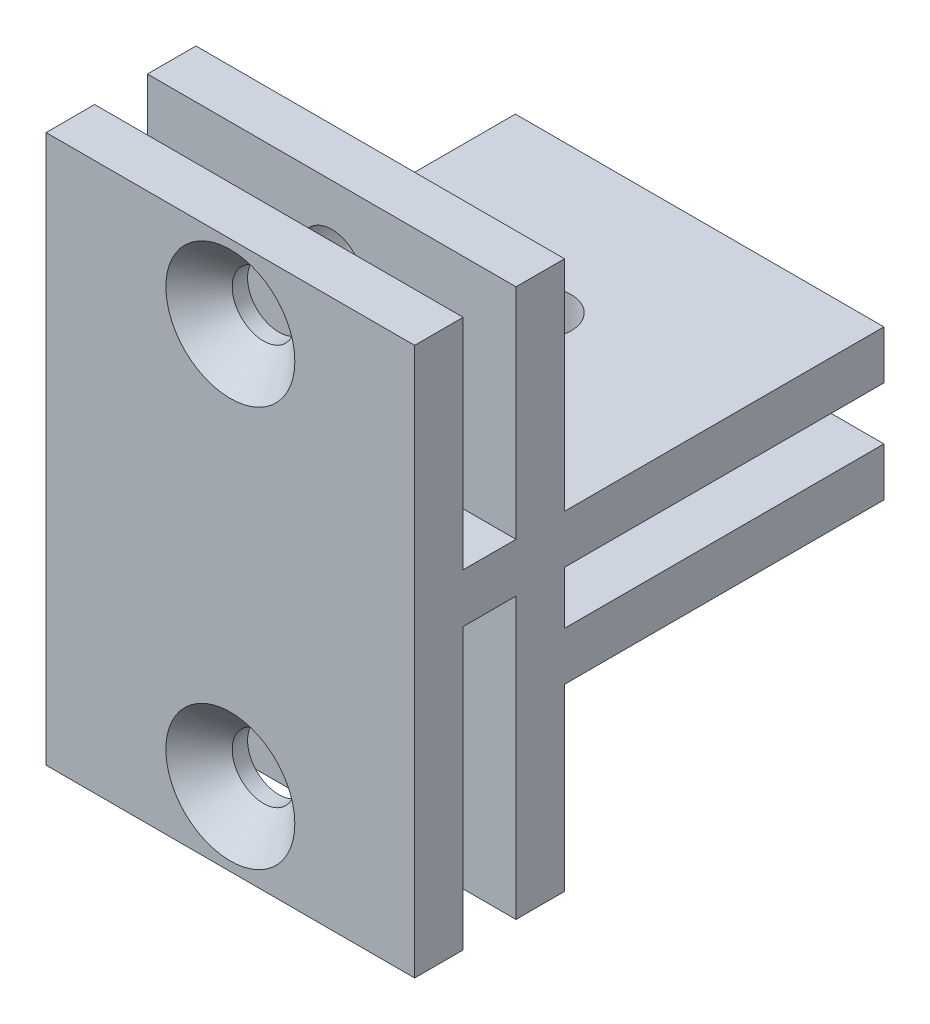
ISO-10303-21;
HEADER;
FILE_DESCRIPTION(('STEP AP214'),'2;1');
FILE_NAME('part.step','',(''),(''),'','','');
FILE_SCHEMA(('AUTOMOTIVE_DESIGN { 1 0 10303 214 1 1 1 1 }'));
ENDSEC;
DATA;
#1=APPLICATION_CONTEXT('core data for automotive mechanical design processes');
#2=APPLICATION_PROTOCOL_DEFINITION('international standard','automotive_design',2000,#1);
#3=PRODUCT_CONTEXT('',#1,'mechanical');
#4=PRODUCT('Part','Part','',(#3));
#5=PRODUCT_RELATED_PRODUCT_CATEGORY('part','',(#4));
#6=PRODUCT_DEFINITION_FORMATION('','',#4);
#7=PRODUCT_DEFINITION_CONTEXT('part definition',#1,'design');
#8=PRODUCT_DEFINITION('design','',#6,#7);
#9=PRODUCT_DEFINITION_SHAPE('','',#8);
#10=(LENGTH_UNIT() NAMED_UNIT(*) SI_UNIT(.MILLI.,.METRE.));
#11=(NAMED_UNIT(*) PLANE_ANGLE_UNIT() SI_UNIT($,.RADIAN.));
#12=(NAMED_UNIT(*) SI_UNIT($,.STERADIAN.) SOLID_ANGLE_UNIT());
#13=UNCERTAINTY_MEASURE_WITH_UNIT(LENGTH_MEASURE(1.E-05),#10,'distance_accuracy_value','');
#14=(GEOMETRIC_REPRESENTATION_CONTEXT(3) GLOBAL_UNCERTAINTY_ASSIGNED_CONTEXT((#13)) GLOBAL_UNIT_ASSIGNED_CONTEXT((#10,
#11,#12)) REPRESENTATION_CONTEXT('',''));
#15=CARTESIAN_POINT('',(0.,0.,0.));
#16=DIRECTION('',(0.,0.,1.));
#17=DIRECTION('',(1.,0.,0.));
#18=AXIS2_PLACEMENT_3D('',#15,#16,#17);
#19=CARTESIAN_POINT('',(0.,0.,-26.));
#20=DIRECTION('',(0.,0.,1.));
#21=DIRECTION('',(1.,0.,0.));
#22=AXIS2_PLACEMENT_3D('',#19,#20,#21);
#23=PLANE('',#22);
#24=DIRECTION('',(0.,-1.,0.));
#25=VECTOR('',#24,1.);
#26=CARTESIAN_POINT('',(-11.0854271356784,19.486432160804,-26.));
#27=LINE('',#26,#25);
#28=CARTESIAN_POINT('',(-11.0854271356784,19.486432160804,-26.));
#29=VERTEX_POINT('',#28);
#30=CARTESIAN_POINT('',(-11.0854271356784,15.536432160804,-26.));
#31=VERTEX_POINT('',#30);
#32=EDGE_CURVE('E235',#29,#31,#27,.T.);
#33=ORIENTED_EDGE('',*,*,#32,.T.);
#34=DIRECTION('',(-1.,0.,0.));
#35=VECTOR('',#34,1.);
#36=CARTESIAN_POINT('',(-11.0854271356784,15.536432160804,-26.));
#37=LINE('',#36,#35);
#38=CARTESIAN_POINT('',(-41.0854271356784,15.536432160804,-26.));
#39=VERTEX_POINT('',#38);
#40=EDGE_CURVE('E218',#31,#39,#37,.T.);
#41=ORIENTED_EDGE('',*,*,#40,.T.);
#42=DIRECTION('',(0.,1.,0.));
#43=VECTOR('',#42,1.);
#44=CARTESIAN_POINT('',(-41.0854271356784,19.486432160804,-26.));
#45=LINE('',#44,#43);
#46=CARTESIAN_POINT('',(-41.0854271356784,19.486432160804,-26.));
#47=VERTEX_POINT('',#46);
#48=EDGE_CURVE('E232',#39,#47,#45,.T.);
#49=ORIENTED_EDGE('',*,*,#48,.T.);
#50=DIRECTION('',(1.,0.,0.));
#51=VECTOR('',#50,1.);
#52=CARTESIAN_POINT('',(-41.0854271356784,19.486432160804,-26.));
#53=LINE('',#52,#51);
#54=EDGE_CURVE('E231',#47,#29,#53,.T.);
#55=ORIENTED_EDGE('',*,*,#54,.T.);
#56=EDGE_LOOP('',(#33,#41,#49,#55));
#57=FACE_BOUND('',#56,.T.);
#58=ADVANCED_FACE('F38',(#57),#23,.F.);
#59=CARTESIAN_POINT('',(0.,0.,0.));
#60=DIRECTION('',(0.,0.,1.));
#61=DIRECTION('',(1.,0.,0.));
#62=AXIS2_PLACEMENT_3D('',#59,#60,#61);
#63=PLANE('',#62);
#64=CARTESIAN_POINT('',(-26.0854271356784,-1.31356783919598,0.));
#65=DIRECTION('',(0.,0.,1.));
#66=DIRECTION('',(1.,0.,0.));
#67=AXIS2_PLACEMENT_3D('',#64,#65,#66);
#68=CIRCLE('',#67,2.54999998);
#69=CARTESIAN_POINT('',(-23.5354271556784,-1.31356783919598,0.));
#70=VERTEX_POINT('',#69);
#71=EDGE_CURVE('E271',#70,#70,#68,.T.);
#72=ORIENTED_EDGE('',*,*,#71,.T.);
#73=EDGE_LOOP('',(#72));
#74=FACE_BOUND('',#73,.T.);
#75=DIRECTION('',(-1.,0.,0.));
#76=VECTOR('',#75,1.);
#77=CARTESIAN_POINT('',(-41.0854271356784,7.28643216080402,0.));
#78=LINE('',#77,#76);
#79=CARTESIAN_POINT('',(-11.0854271356784,7.28643216080402,0.));
#80=VERTEX_POINT('',#79);
#81=CARTESIAN_POINT('',(-41.0854271356784,7.28643216080402,0.));
#82=VERTEX_POINT('',#81);
#83=EDGE_CURVE('E64',#80,#82,#78,.T.);
#84=ORIENTED_EDGE('',*,*,#83,.F.);
#85=DIRECTION('',(0.,1.,0.));
#86=VECTOR('',#85,1.);
#87=CARTESIAN_POINT('',(-11.0854271356784,37.286432160804,0.));
#88=LINE('',#87,#86);
#89=CARTESIAN_POINT('',(-11.0854271356784,-7.31356783919598,0.));
#90=VERTEX_POINT('',#89);
#91=EDGE_CURVE('E391',#90,#80,#88,.T.);
#92=ORIENTED_EDGE('',*,*,#91,.F.);
#93=DIRECTION('',(1.,0.,0.));
#94=VECTOR('',#93,1.);
#95=CARTESIAN_POINT('',(-41.0854271356784,-7.31356783919598,0.));
#96=LINE('',#95,#94);
#97=CARTESIAN_POINT('',(-41.0854271356784,-7.31356783919598,0.));
#98=VERTEX_POINT('',#97);
#99=EDGE_CURVE('E386',#98,#90,#96,.T.);
#100=ORIENTED_EDGE('',*,*,#99,.F.);
#101=DIRECTION('',(0.,-1.,0.));
#102=VECTOR('',#101,1.);
#103=CARTESIAN_POINT('',(-41.0854271356784,37.286432160804,0.));
#104=LINE('',#103,#102);
#105=EDGE_CURVE('E357',#82,#98,#104,.T.);
#106=ORIENTED_EDGE('',*,*,#105,.F.);
#107=EDGE_LOOP('',(#84,#92,#100,#106));
#108=FACE_BOUND('',#107,.T.);
#109=ADVANCED_FACE('F440',(#74,#108),#63,.F.);
#110=CARTESIAN_POINT('',(-26.0854271356784,31.286432160804,0.));
#111=DIRECTION('',(0.,0.,1.));
#112=DIRECTION('',(1.,0.,0.));
#113=AXIS2_PLACEMENT_3D('',#110,#111,#112);
#114=CIRCLE('',#113,2.54999998);
#115=CARTESIAN_POINT('',(-23.5354271556784,31.286432160804,0.));
#116=VERTEX_POINT('',#115);
#117=EDGE_CURVE('E288',#116,#116,#114,.T.);
#118=ORIENTED_EDGE('',*,*,#117,.T.);
#119=EDGE_LOOP('',(#118));
#120=FACE_BOUND('',#119,.T.);
#121=DIRECTION('',(1.,0.,0.));
#122=VECTOR('',#121,1.);
#123=CARTESIAN_POINT('',(-41.0854271356784,19.486432160804,0.));
#124=LINE('',#123,#122);
#125=CARTESIAN_POINT('',(-41.0854271356784,19.486432160804,0.));
#126=VERTEX_POINT('',#125);
#127=CARTESIAN_POINT('',(-11.0854271356784,19.486432160804,0.));
#128=VERTEX_POINT('',#127);
#129=EDGE_CURVE('E222',#126,#128,#124,.T.);
#130=ORIENTED_EDGE('',*,*,#129,.F.);
#131=CARTESIAN_POINT('',(-41.0854271356784,37.286432160804,0.));
#132=VERTEX_POINT('',#131);
#133=EDGE_CURVE('E382',#132,#126,#104,.T.);
#134=ORIENTED_EDGE('',*,*,#133,.F.);
#135=DIRECTION('',(-1.,0.,0.));
#136=VECTOR('',#135,1.);
#137=CARTESIAN_POINT('',(-41.0854271356784,37.286432160804,0.));
#138=LINE('',#137,#136);
#139=CARTESIAN_POINT('',(-11.0854271356784,37.286432160804,0.));
#140=VERTEX_POINT('',#139);
#141=EDGE_CURVE('E372',#140,#132,#138,.T.);
#142=ORIENTED_EDGE('',*,*,#141,.F.);
#143=EDGE_CURVE('E390',#128,#140,#88,.T.);
#144=ORIENTED_EDGE('',*,*,#143,.F.);
#145=EDGE_LOOP('',(#130,#134,#142,#144));
#146=FACE_BOUND('',#145,.T.);
#147=ADVANCED_FACE('F447',(#120,#146),#63,.F.);
#148=CARTESIAN_POINT('',(-41.0854271356784,-7.31356783919598,12.2));
#149=DIRECTION('',(0.,1.,0.));
#150=DIRECTION('',(0.,0.,1.));
#151=AXIS2_PLACEMENT_3D('',#148,#149,#150);
#152=PLANE('',#151);
#153=DIRECTION('',(0.,0.,-1.));
#154=VECTOR('',#153,1.);
#155=CARTESIAN_POINT('',(-11.0854271356784,-7.31356783919598,12.2));
#156=LINE('',#155,#154);
#157=CARTESIAN_POINT('',(-11.0854271356784,-7.31356783919598,3.95));
#158=VERTEX_POINT('',#157);
#159=EDGE_CURVE('E406',#158,#90,#156,.T.);
#160=ORIENTED_EDGE('',*,*,#159,.F.);
#161=DIRECTION('',(1.,0.,0.));
#162=VECTOR('',#161,1.);
#163=CARTESIAN_POINT('',(-11.0854271356784,-7.31356783919598,3.95));
#164=LINE('',#163,#162);
#165=CARTESIAN_POINT('',(-41.0854271356784,-7.31356783919598,3.95));
#166=VERTEX_POINT('',#165);
#167=EDGE_CURVE('E303',#166,#158,#164,.T.);
#168=ORIENTED_EDGE('',*,*,#167,.F.);
#169=DIRECTION('',(0.,0.,-1.));
#170=VECTOR('',#169,1.);
#171=CARTESIAN_POINT('',(-41.0854271356784,-7.31356783919598,12.2));
#172=LINE('',#171,#170);
#173=EDGE_CURVE('E48',#166,#98,#172,.T.);
#174=ORIENTED_EDGE('',*,*,#173,.T.);
#175=ORIENTED_EDGE('',*,*,#99,.T.);
#176=EDGE_LOOP('',(#160,#168,#174,#175));
#177=FACE_BOUND('',#176,.T.);
#178=ADVANCED_FACE('F499',(#177),#152,.F.);
#179=CARTESIAN_POINT('',(-41.0854271356784,37.286432160804,12.2));
#180=DIRECTION('',(0.,-1.,0.));
#181=DIRECTION('',(0.,0.,-1.));
#182=AXIS2_PLACEMENT_3D('',#179,#180,#181);
#183=PLANE('',#182);
#184=DIRECTION('',(0.,0.,-1.));
#185=VECTOR('',#184,1.);
#186=CARTESIAN_POINT('',(-41.0854271356784,37.286432160804,12.2));
#187=LINE('',#186,#185);
#188=CARTESIAN_POINT('',(-41.0854271356784,37.286432160804,3.95));
#189=VERTEX_POINT('',#188);
#190=EDGE_CURVE('E381',#189,#132,#187,.T.);
#191=ORIENTED_EDGE('',*,*,#190,.F.);
#192=DIRECTION('',(-1.,0.,0.));
#193=VECTOR('',#192,1.);
#194=CARTESIAN_POINT('',(-41.0854271356784,37.286432160804,3.95));
#195=LINE('',#194,#193);
#196=CARTESIAN_POINT('',(-11.0854271356784,37.286432160804,3.95));
#197=VERTEX_POINT('',#196);
#198=EDGE_CURVE('E337',#197,#189,#195,.T.);
#199=ORIENTED_EDGE('',*,*,#198,.F.);
#200=DIRECTION('',(0.,0.,-1.));
#201=VECTOR('',#200,1.);
#202=CARTESIAN_POINT('',(-11.0854271356784,37.286432160804,12.2));
#203=LINE('',#202,#201);
#204=EDGE_CURVE('E401',#197,#140,#203,.T.);
#205=ORIENTED_EDGE('',*,*,#204,.T.);
#206=ORIENTED_EDGE('',*,*,#141,.T.);
#207=EDGE_LOOP('',(#191,#199,#205,#206));
#208=FACE_BOUND('',#207,.T.);
#209=ADVANCED_FACE('F486',(#208),#183,.F.);
#210=CARTESIAN_POINT('',(-41.0854271356784,37.286432160804,12.2));
#211=DIRECTION('',(1.,0.,0.));
#212=DIRECTION('',(0.,0.,-1.));
#213=AXIS2_PLACEMENT_3D('',#210,#211,#212);
#214=PLANE('',#213);
#215=ORIENTED_EDGE('',*,*,#48,.F.);
#216=DIRECTION('',(0.,0.,-1.));
#217=VECTOR('',#216,1.);
#218=CARTESIAN_POINT('',(-41.0854271356784,15.536432160804,-26.));
#219=LINE('',#218,#217);
#220=CARTESIAN_POINT('',(-41.0854271356784,15.536432160804,0.));
#221=VERTEX_POINT('',#220);
#222=EDGE_CURVE('E203',#221,#39,#219,.T.);
#223=ORIENTED_EDGE('',*,*,#222,.F.);
#224=DIRECTION('',(0.,1.,0.));
#225=VECTOR('',#224,1.);
#226=CARTESIAN_POINT('',(-41.0854271356784,11.236432160804,0.));
#227=LINE('',#226,#225);
#228=CARTESIAN_POINT('',(-41.0854271356784,11.236432160804,0.));
#229=VERTEX_POINT('',#228);
#230=EDGE_CURVE('E206',#229,#221,#227,.T.);
#231=ORIENTED_EDGE('',*,*,#230,.F.);
#232=DIRECTION('',(0.,0.,1.));
#233=VECTOR('',#232,1.);
#234=CARTESIAN_POINT('',(-41.0854271356784,11.236432160804,-26.));
#235=LINE('',#234,#233);
#236=CARTESIAN_POINT('',(-41.0854271356784,11.236432160804,-26.));
#237=VERTEX_POINT('',#236);
#238=EDGE_CURVE('E181',#237,#229,#235,.T.);
#239=ORIENTED_EDGE('',*,*,#238,.F.);
#240=CARTESIAN_POINT('',(-41.0854271356784,7.28643216080402,-26.));
#241=VERTEX_POINT('',#240);
#242=EDGE_CURVE('E227',#241,#237,#45,.T.);
#243=ORIENTED_EDGE('',*,*,#242,.F.);
#244=DIRECTION('',(0.,0.,1.));
#245=VECTOR('',#244,1.);
#246=CARTESIAN_POINT('',(-41.0854271356784,7.28643216080402,-26.));
#247=LINE('',#246,#245);
#248=EDGE_CURVE('E242',#241,#82,#247,.T.);
#249=ORIENTED_EDGE('',*,*,#248,.T.);
#250=ORIENTED_EDGE('',*,*,#105,.T.);
#251=ORIENTED_EDGE('',*,*,#173,.F.);
#252=DIRECTION('',(0.,-1.,0.));
#253=VECTOR('',#252,1.);
#254=CARTESIAN_POINT('',(-41.0854271356784,15.486432160804,3.95));
#255=LINE('',#254,#253);
#256=CARTESIAN_POINT('',(-41.0854271356784,15.486432160804,3.95));
#257=VERTEX_POINT('',#256);
#258=EDGE_CURVE('E323',#257,#166,#255,.T.);
#259=ORIENTED_EDGE('',*,*,#258,.F.);
#260=DIRECTION('',(0.,0.,-1.));
#261=VECTOR('',#260,1.);
#262=CARTESIAN_POINT('',(-41.0854271356784,15.486432160804,3.95));
#263=LINE('',#262,#261);
#264=CARTESIAN_POINT('',(-41.0854271356784,15.486432160804,8.25));
#265=VERTEX_POINT('',#264);
#266=EDGE_CURVE('E307',#265,#257,#263,.T.);
#267=ORIENTED_EDGE('',*,*,#266,.F.);
#268=DIRECTION('',(0.,-1.,0.));
#269=VECTOR('',#268,1.);
#270=CARTESIAN_POINT('',(-41.0854271356784,15.486432160804,8.25));
#271=LINE('',#270,#269);
#272=CARTESIAN_POINT('',(-41.0854271356784,-7.31356783919598,8.25));
#273=VERTEX_POINT('',#272);
#274=EDGE_CURVE('E326',#265,#273,#271,.T.);
#275=ORIENTED_EDGE('',*,*,#274,.T.);
#276=CARTESIAN_POINT('',(-41.0854271356784,-7.31356783919598,12.2));
#277=VERTEX_POINT('',#276);
#278=EDGE_CURVE('E11',#277,#273,#172,.T.);
#279=ORIENTED_EDGE('',*,*,#278,.F.);
#280=DIRECTION('',(0.,-1.,0.));
#281=VECTOR('',#280,1.);
#282=CARTESIAN_POINT('',(-41.0854271356784,37.286432160804,12.2));
#283=LINE('',#282,#281);
#284=CARTESIAN_POINT('',(-41.0854271356784,37.286432160804,12.2));
#285=VERTEX_POINT('',#284);
#286=EDGE_CURVE('E367',#285,#277,#283,.T.);
#287=ORIENTED_EDGE('',*,*,#286,.F.);
#288=CARTESIAN_POINT('',(-41.0854271356784,37.286432160804,8.25));
#289=VERTEX_POINT('',#288);
#290=EDGE_CURVE('E397',#285,#289,#187,.T.);
#291=ORIENTED_EDGE('',*,*,#290,.T.);
#292=DIRECTION('',(0.,1.,0.));
#293=VECTOR('',#292,1.);
#294=CARTESIAN_POINT('',(-41.0854271356784,19.486432160804,8.25));
#295=LINE('',#294,#293);
#296=CARTESIAN_POINT('',(-41.0854271356784,19.486432160804,8.25));
#297=VERTEX_POINT('',#296);
#298=EDGE_CURVE('E348',#297,#289,#295,.T.);
#299=ORIENTED_EDGE('',*,*,#298,.F.);
#300=DIRECTION('',(0.,0.,1.));
#301=VECTOR('',#300,1.);
#302=CARTESIAN_POINT('',(-41.0854271356784,19.486432160804,3.95));
#303=LINE('',#302,#301);
#304=CARTESIAN_POINT('',(-41.0854271356784,19.486432160804,3.95));
#305=VERTEX_POINT('',#304);
#306=EDGE_CURVE('E332',#305,#297,#303,.T.);
#307=ORIENTED_EDGE('',*,*,#306,.F.);
#308=DIRECTION('',(0.,1.,0.));
#309=VECTOR('',#308,1.);
#310=CARTESIAN_POINT('',(-41.0854271356784,19.486432160804,3.95));
#311=LINE('',#310,#309);
#312=EDGE_CURVE('E353',#305,#189,#311,.T.);
#313=ORIENTED_EDGE('',*,*,#312,.T.);
#314=ORIENTED_EDGE('',*,*,#190,.T.);
#315=ORIENTED_EDGE('',*,*,#133,.T.);
#316=DIRECTION('',(0.,0.,1.));
#317=VECTOR('',#316,1.);
#318=CARTESIAN_POINT('',(-41.0854271356784,19.486432160804,-26.));
#319=LINE('',#318,#317);
#320=EDGE_CURVE('E259',#47,#126,#319,.T.);
#321=ORIENTED_EDGE('',*,*,#320,.F.);
#322=EDGE_LOOP('',(#215,#223,#231,#239,#243,#249,#250,#251,#259,#267,#275,#279,#287,#291,#299,
#307,#313,#314,#315,#321));
#323=FACE_BOUND('',#322,.T.);
#324=ADVANCED_FACE('F40',(#323),#214,.F.);
#325=ORIENTED_EDGE('',*,*,#278,.T.);
#326=DIRECTION('',(-1.,0.,0.));
#327=VECTOR('',#326,1.);
#328=CARTESIAN_POINT('',(-11.0854271356784,-7.31356783919598,8.25));
#329=LINE('',#328,#327);
#330=CARTESIAN_POINT('',(-11.0854271356784,-7.31356783919598,8.25));
#331=VERTEX_POINT('',#330);
#332=EDGE_CURVE('E297',#331,#273,#329,.T.);
#333=ORIENTED_EDGE('',*,*,#332,.F.);
#334=CARTESIAN_POINT('',(-11.0854271356784,-7.31356783919598,12.2));
#335=VERTEX_POINT('',#334);
#336=EDGE_CURVE('E407',#335,#331,#156,.T.);
#337=ORIENTED_EDGE('',*,*,#336,.F.);
#338=DIRECTION('',(1.,0.,0.));
#339=VECTOR('',#338,1.);
#340=CARTESIAN_POINT('',(-41.0854271356784,-7.31356783919598,12.2));
#341=LINE('',#340,#339);
#342=EDGE_CURVE('E371',#277,#335,#341,.T.);
#343=ORIENTED_EDGE('',*,*,#342,.F.);
#344=EDGE_LOOP('',(#325,#333,#337,#343));
#345=FACE_BOUND('',#344,.T.);
#346=ADVANCED_FACE('F515',(#345),#152,.F.);
#347=CARTESIAN_POINT('',(-11.0854271356784,37.286432160804,12.2));
#348=DIRECTION('',(-1.,0.,0.));
#349=DIRECTION('',(0.,-1.,0.));
#350=AXIS2_PLACEMENT_3D('',#347,#348,#349);
#351=PLANE('',#350);
#352=DIRECTION('',(0.,1.,0.));
#353=VECTOR('',#352,1.);
#354=CARTESIAN_POINT('',(-11.0854271356784,11.236432160804,0.));
#355=LINE('',#354,#353);
#356=CARTESIAN_POINT('',(-11.0854271356784,11.236432160804,0.));
#357=VERTEX_POINT('',#356);
#358=CARTESIAN_POINT('',(-11.0854271356784,15.536432160804,0.));
#359=VERTEX_POINT('',#358);
#360=EDGE_CURVE('E190',#357,#359,#355,.T.);
#361=ORIENTED_EDGE('',*,*,#360,.T.);
#362=DIRECTION('',(0.,0.,-1.));
#363=VECTOR('',#362,1.);
#364=CARTESIAN_POINT('',(-11.0854271356784,15.536432160804,-26.));
#365=LINE('',#364,#363);
#366=EDGE_CURVE('E196',#359,#31,#365,.T.);
#367=ORIENTED_EDGE('',*,*,#366,.T.);
#368=ORIENTED_EDGE('',*,*,#32,.F.);
#369=DIRECTION('',(0.,0.,1.));
#370=VECTOR('',#369,1.);
#371=CARTESIAN_POINT('',(-11.0854271356784,19.486432160804,-26.));
#372=LINE('',#371,#370);
#373=EDGE_CURVE('E255',#29,#128,#372,.T.);
#374=ORIENTED_EDGE('',*,*,#373,.T.);
#375=ORIENTED_EDGE('',*,*,#143,.T.);
#376=ORIENTED_EDGE('',*,*,#204,.F.);
#377=DIRECTION('',(0.,1.,0.));
#378=VECTOR('',#377,1.);
#379=CARTESIAN_POINT('',(-11.0854271356784,19.486432160804,3.95));
#380=LINE('',#379,#378);
#381=CARTESIAN_POINT('',(-11.0854271356784,19.486432160804,3.95));
#382=VERTEX_POINT('',#381);
#383=EDGE_CURVE('E358',#382,#197,#380,.T.);
#384=ORIENTED_EDGE('',*,*,#383,.F.);
#385=DIRECTION('',(0.,0.,-1.));
#386=VECTOR('',#385,1.);
#387=CARTESIAN_POINT('',(-11.0854271356784,19.486432160804,3.95));
#388=LINE('',#387,#386);
#389=CARTESIAN_POINT('',(-11.0854271356784,19.486432160804,8.25));
#390=VERTEX_POINT('',#389);
#391=EDGE_CURVE('E341',#390,#382,#388,.T.);
#392=ORIENTED_EDGE('',*,*,#391,.F.);
#393=DIRECTION('',(0.,1.,0.));
#394=VECTOR('',#393,1.);
#395=CARTESIAN_POINT('',(-11.0854271356784,19.486432160804,8.25));
#396=LINE('',#395,#394);
#397=CARTESIAN_POINT('',(-11.0854271356784,37.286432160804,8.25));
#398=VERTEX_POINT('',#397);
#399=EDGE_CURVE('E361',#390,#398,#396,.T.);
#400=ORIENTED_EDGE('',*,*,#399,.T.);
#401=CARTESIAN_POINT('',(-11.0854271356784,37.286432160804,12.2));
#402=VERTEX_POINT('',#401);
#403=EDGE_CURVE('E402',#402,#398,#203,.T.);
#404=ORIENTED_EDGE('',*,*,#403,.F.);
#405=DIRECTION('',(0.,1.,0.));
#406=VECTOR('',#405,1.);
#407=CARTESIAN_POINT('',(-11.0854271356784,37.286432160804,12.2));
#408=LINE('',#407,#406);
#409=EDGE_CURVE('E375',#335,#402,#408,.T.);
#410=ORIENTED_EDGE('',*,*,#409,.F.);
#411=ORIENTED_EDGE('',*,*,#336,.T.);
#412=DIRECTION('',(0.,-1.,0.));
#413=VECTOR('',#412,1.);
#414=CARTESIAN_POINT('',(-11.0854271356784,15.486432160804,8.25));
#415=LINE('',#414,#413);
#416=CARTESIAN_POINT('',(-11.0854271356784,15.486432160804,8.25));
#417=VERTEX_POINT('',#416);
#418=EDGE_CURVE('E313',#417,#331,#415,.T.);
#419=ORIENTED_EDGE('',*,*,#418,.F.);
#420=DIRECTION('',(0.,0.,1.));
#421=VECTOR('',#420,1.);
#422=CARTESIAN_POINT('',(-11.0854271356784,15.486432160804,3.95));
#423=LINE('',#422,#421);
#424=CARTESIAN_POINT('',(-11.0854271356784,15.486432160804,3.95));
#425=VERTEX_POINT('',#424);
#426=EDGE_CURVE('E298',#425,#417,#423,.T.);
#427=ORIENTED_EDGE('',*,*,#426,.F.);
#428=DIRECTION('',(0.,-1.,0.));
#429=VECTOR('',#428,1.);
#430=CARTESIAN_POINT('',(-11.0854271356784,15.486432160804,3.95));
#431=LINE('',#430,#429);
#432=EDGE_CURVE('E318',#425,#158,#431,.T.);
#433=ORIENTED_EDGE('',*,*,#432,.T.);
#434=ORIENTED_EDGE('',*,*,#159,.T.);
#435=ORIENTED_EDGE('',*,*,#91,.T.);
#436=DIRECTION('',(0.,0.,1.));
#437=VECTOR('',#436,1.);
#438=CARTESIAN_POINT('',(-11.0854271356784,7.28643216080402,-26.));
#439=LINE('',#438,#437);
#440=CARTESIAN_POINT('',(-11.0854271356784,7.28643216080402,-26.));
#441=VERTEX_POINT('',#440);
#442=EDGE_CURVE('E251',#441,#80,#439,.T.);
#443=ORIENTED_EDGE('',*,*,#442,.F.);
#444=CARTESIAN_POINT('',(-11.0854271356784,11.236432160804,-26.));
#445=VERTEX_POINT('',#444);
#446=EDGE_CURVE('E201',#445,#441,#27,.T.);
#447=ORIENTED_EDGE('',*,*,#446,.F.);
#448=DIRECTION('',(0.,0.,1.));
#449=VECTOR('',#448,1.);
#450=CARTESIAN_POINT('',(-11.0854271356784,11.236432160804,-26.));
#451=LINE('',#450,#449);
#452=EDGE_CURVE('E56',#445,#357,#451,.T.);
#453=ORIENTED_EDGE('',*,*,#452,.T.);
#454=EDGE_LOOP('',(#361,#367,#368,#374,#375,#376,#384,#392,#400,#404,#410,#411,#419,#427,#433,
#434,#435,#443,#447,#453));
#455=FACE_BOUND('',#454,.T.);
#456=ADVANCED_FACE('F199',(#455),#351,.F.);
#457=ORIENTED_EDGE('',*,*,#403,.T.);
#458=DIRECTION('',(1.,0.,0.));
#459=VECTOR('',#458,1.);
#460=CARTESIAN_POINT('',(-41.0854271356784,37.286432160804,8.25));
#461=LINE('',#460,#459);
#462=EDGE_CURVE('E322',#289,#398,#461,.T.);
#463=ORIENTED_EDGE('',*,*,#462,.F.);
#464=ORIENTED_EDGE('',*,*,#290,.F.);
#465=DIRECTION('',(-1.,0.,0.));
#466=VECTOR('',#465,1.);
#467=CARTESIAN_POINT('',(-41.0854271356784,37.286432160804,12.2));
#468=LINE('',#467,#466);
#469=EDGE_CURVE('E378',#402,#285,#468,.T.);
#470=ORIENTED_EDGE('',*,*,#469,.F.);
#471=EDGE_LOOP('',(#457,#463,#464,#470));
#472=FACE_BOUND('',#471,.T.);
#473=ADVANCED_FACE('F526',(#472),#183,.F.);
#474=CARTESIAN_POINT('',(0.,0.,12.2));
#475=DIRECTION('',(0.,0.,1.));
#476=DIRECTION('',(1.,0.,0.));
#477=AXIS2_PLACEMENT_3D('',#474,#475,#476);
#478=PLANE('',#477);
#479=CARTESIAN_POINT('',(-26.0854271356784,-1.31356783919598,12.2));
#480=DIRECTION('',(0.,0.,1.));
#481=DIRECTION('',(1.,0.,0.));
#482=AXIS2_PLACEMENT_3D('',#479,#480,#481);
#483=CIRCLE('',#482,5.250000041);
#484=CARTESIAN_POINT('',(-20.8354270946784,-1.31356783919598,12.2));
#485=VERTEX_POINT('',#484);
#486=EDGE_CURVE('E263',#485,#485,#483,.T.);
#487=ORIENTED_EDGE('',*,*,#486,.F.);
#488=EDGE_LOOP('',(#487));
#489=FACE_BOUND('',#488,.T.);
#490=CARTESIAN_POINT('',(-26.0854271356784,31.286432160804,12.2));
#491=DIRECTION('',(0.,0.,1.));
#492=DIRECTION('',(1.,0.,0.));
#493=AXIS2_PLACEMENT_3D('',#490,#491,#492);
#494=CIRCLE('',#493,5.250000041);
#495=CARTESIAN_POINT('',(-20.8354270946784,31.286432160804,12.2));
#496=VERTEX_POINT('',#495);
#497=EDGE_CURVE('E280',#496,#496,#494,.T.);
#498=ORIENTED_EDGE('',*,*,#497,.F.);
#499=EDGE_LOOP('',(#498));
#500=FACE_BOUND('',#499,.T.);
#501=ORIENTED_EDGE('',*,*,#286,.T.);
#502=ORIENTED_EDGE('',*,*,#342,.T.);
#503=ORIENTED_EDGE('',*,*,#409,.T.);
#504=ORIENTED_EDGE('',*,*,#469,.T.);
#505=EDGE_LOOP('',(#501,#502,#503,#504));
#506=FACE_BOUND('',#505,.T.);
#507=ADVANCED_FACE('F520',(#489,#500,#506),#478,.T.);
#508=CARTESIAN_POINT('',(-41.0854271356784,19.486432160804,3.95));
#509=DIRECTION('',(0.,0.,-1.));
#510=DIRECTION('',(-1.,0.,0.));
#511=AXIS2_PLACEMENT_3D('',#508,#509,#510);
#512=PLANE('',#511);
#513=CARTESIAN_POINT('',(-26.0854271356784,31.286432160804,3.95));
#514=DIRECTION('',(0.,0.,-1.));
#515=DIRECTION('',(-1.,0.,0.));
#516=AXIS2_PLACEMENT_3D('',#513,#514,#515);
#517=CIRCLE('',#516,2.54999998);
#518=CARTESIAN_POINT('',(-28.6354271156784,31.286432160804,3.95));
#519=VERTEX_POINT('',#518);
#520=EDGE_CURVE('E292',#519,#519,#517,.T.);
#521=ORIENTED_EDGE('',*,*,#520,.T.);
#522=EDGE_LOOP('',(#521));
#523=FACE_BOUND('',#522,.T.);
#524=ORIENTED_EDGE('',*,*,#198,.T.);
#525=ORIENTED_EDGE('',*,*,#312,.F.);
#526=DIRECTION('',(-1.,0.,0.));
#527=VECTOR('',#526,1.);
#528=CARTESIAN_POINT('',(-41.0854271356784,19.486432160804,3.95));
#529=LINE('',#528,#527);
#530=EDGE_CURVE('E344',#382,#305,#529,.T.);
#531=ORIENTED_EDGE('',*,*,#530,.F.);
#532=ORIENTED_EDGE('',*,*,#383,.T.);
#533=EDGE_LOOP('',(#524,#525,#531,#532));
#534=FACE_BOUND('',#533,.T.);
#535=ADVANCED_FACE('F534',(#523,#534),#512,.F.);
#536=CARTESIAN_POINT('',(-41.0854271356784,19.486432160804,8.25));
#537=DIRECTION('',(0.,0.,1.));
#538=DIRECTION('',(1.,0.,0.));
#539=AXIS2_PLACEMENT_3D('',#536,#537,#538);
#540=PLANE('',#539);
#541=CARTESIAN_POINT('',(-26.0854271356784,31.286432160804,8.25));
#542=DIRECTION('',(0.,0.,1.));
#543=DIRECTION('',(1.,0.,0.));
#544=AXIS2_PLACEMENT_3D('',#541,#542,#543);
#545=CIRCLE('',#544,2.54999998);
#546=CARTESIAN_POINT('',(-23.5354271556784,31.286432160804,8.25));
#547=VERTEX_POINT('',#546);
#548=EDGE_CURVE('E293',#547,#547,#545,.T.);
#549=ORIENTED_EDGE('',*,*,#548,.T.);
#550=EDGE_LOOP('',(#549));
#551=FACE_BOUND('',#550,.T.);
#552=ORIENTED_EDGE('',*,*,#462,.T.);
#553=ORIENTED_EDGE('',*,*,#399,.F.);
#554=DIRECTION('',(1.,0.,0.));
#555=VECTOR('',#554,1.);
#556=CARTESIAN_POINT('',(-41.0854271356784,19.486432160804,8.25));
#557=LINE('',#556,#555);
#558=EDGE_CURVE('E336',#297,#390,#557,.T.);
#559=ORIENTED_EDGE('',*,*,#558,.F.);
#560=ORIENTED_EDGE('',*,*,#298,.T.);
#561=EDGE_LOOP('',(#552,#553,#559,#560));
#562=FACE_BOUND('',#561,.T.);
#563=ADVANCED_FACE('F528',(#551,#562),#540,.F.);
#564=CARTESIAN_POINT('',(0.,19.486432160804,0.));
#565=DIRECTION('',(0.,1.,0.));
#566=DIRECTION('',(0.,0.,1.));
#567=AXIS2_PLACEMENT_3D('',#564,#565,#566);
#568=PLANE('',#567);
#569=ORIENTED_EDGE('',*,*,#306,.T.);
#570=ORIENTED_EDGE('',*,*,#558,.T.);
#571=ORIENTED_EDGE('',*,*,#391,.T.);
#572=ORIENTED_EDGE('',*,*,#530,.T.);
#573=EDGE_LOOP('',(#569,#570,#571,#572));
#574=FACE_BOUND('',#573,.T.);
#575=ADVANCED_FACE('F532',(#574),#568,.T.);
#576=CARTESIAN_POINT('',(-11.0854271356784,15.486432160804,3.95));
#577=DIRECTION('',(0.,0.,-1.));
#578=DIRECTION('',(-1.,0.,0.));
#579=AXIS2_PLACEMENT_3D('',#576,#577,#578);
#580=PLANE('',#579);
#581=CARTESIAN_POINT('',(-26.0854271356784,-1.31356783919598,3.95));
#582=DIRECTION('',(0.,0.,-1.));
#583=DIRECTION('',(-1.,0.,0.));
#584=AXIS2_PLACEMENT_3D('',#581,#582,#583);
#585=CIRCLE('',#584,2.54999998);
#586=CARTESIAN_POINT('',(-28.6354271156784,-1.31356783919598,3.95));
#587=VERTEX_POINT('',#586);
#588=EDGE_CURVE('E275',#587,#587,#585,.T.);
#589=ORIENTED_EDGE('',*,*,#588,.T.);
#590=EDGE_LOOP('',(#589));
#591=FACE_BOUND('',#590,.T.);
#592=ORIENTED_EDGE('',*,*,#167,.T.);
#593=ORIENTED_EDGE('',*,*,#432,.F.);
#594=DIRECTION('',(1.,0.,0.));
#595=VECTOR('',#594,1.);
#596=CARTESIAN_POINT('',(-11.0854271356784,15.486432160804,3.95));
#597=LINE('',#596,#595);
#598=EDGE_CURVE('E310',#257,#425,#597,.T.);
#599=ORIENTED_EDGE('',*,*,#598,.F.);
#600=ORIENTED_EDGE('',*,*,#258,.T.);
#601=EDGE_LOOP('',(#592,#593,#599,#600));
#602=FACE_BOUND('',#601,.T.);
#603=ADVANCED_FACE('F417',(#591,#602),#580,.F.);
#604=CARTESIAN_POINT('',(-11.0854271356784,15.486432160804,8.25));
#605=DIRECTION('',(0.,0.,1.));
#606=DIRECTION('',(1.,0.,0.));
#607=AXIS2_PLACEMENT_3D('',#604,#605,#606);
#608=PLANE('',#607);
#609=CARTESIAN_POINT('',(-26.0854271356784,-1.31356783919598,8.25));
#610=DIRECTION('',(0.,0.,1.));
#611=DIRECTION('',(1.,0.,0.));
#612=AXIS2_PLACEMENT_3D('',#609,#610,#611);
#613=CIRCLE('',#612,2.54999998);
#614=CARTESIAN_POINT('',(-23.5354271556784,-1.31356783919598,8.25));
#615=VERTEX_POINT('',#614);
#616=EDGE_CURVE('E276',#615,#615,#613,.T.);
#617=ORIENTED_EDGE('',*,*,#616,.T.);
#618=EDGE_LOOP('',(#617));
#619=FACE_BOUND('',#618,.T.);
#620=ORIENTED_EDGE('',*,*,#332,.T.);
#621=ORIENTED_EDGE('',*,*,#274,.F.);
#622=DIRECTION('',(-1.,0.,0.));
#623=VECTOR('',#622,1.);
#624=CARTESIAN_POINT('',(-11.0854271356784,15.486432160804,8.25));
#625=LINE('',#624,#623);
#626=EDGE_CURVE('E302',#417,#265,#625,.T.);
#627=ORIENTED_EDGE('',*,*,#626,.F.);
#628=ORIENTED_EDGE('',*,*,#418,.T.);
#629=EDGE_LOOP('',(#620,#621,#627,#628));
#630=FACE_BOUND('',#629,.T.);
#631=ADVANCED_FACE('F511',(#619,#630),#608,.F.);
#632=CARTESIAN_POINT('',(0.,15.486432160804,0.));
#633=DIRECTION('',(0.,-1.,0.));
#634=DIRECTION('',(1.,0.,0.));
#635=AXIS2_PLACEMENT_3D('',#632,#633,#634);
#636=PLANE('',#635);
#637=ORIENTED_EDGE('',*,*,#426,.T.);
#638=ORIENTED_EDGE('',*,*,#626,.T.);
#639=ORIENTED_EDGE('',*,*,#266,.T.);
#640=ORIENTED_EDGE('',*,*,#598,.T.);
#641=EDGE_LOOP('',(#637,#638,#639,#640));
#642=FACE_BOUND('',#641,.T.);
#643=ADVANCED_FACE('F509',(#642),#636,.T.);
#644=CARTESIAN_POINT('',(-26.0854271356784,31.286432160804,12.2));
#645=DIRECTION('',(0.,0.,1.));
#646=DIRECTION('',(1.,0.,0.));
#647=AXIS2_PLACEMENT_3D('',#644,#645,#646);
#648=CYLINDRICAL_SURFACE('',#647,2.54999998);
#649=ORIENTED_EDGE('',*,*,#117,.F.);
#650=EDGE_LOOP('',(#649));
#651=FACE_BOUND('',#650,.T.);
#652=ORIENTED_EDGE('',*,*,#520,.F.);
#653=EDGE_LOOP('',(#652));
#654=FACE_BOUND('',#653,.T.);
#655=ADVANCED_FACE('F566',(#651,#654),#648,.F.);
#656=CARTESIAN_POINT('',(-26.0854271356784,31.286432160804,9.499999939));
#657=DIRECTION('',(0.,0.,1.));
#658=DIRECTION('',(1.,0.,0.));
#659=AXIS2_PLACEMENT_3D('',#656,#657,#658);
#660=CIRCLE('',#659,2.54999998);
#661=CARTESIAN_POINT('',(-23.5354271556784,31.286432160804,9.499999939));
#662=VERTEX_POINT('',#661);
#663=EDGE_CURVE('E284',#662,#662,#660,.T.);
#664=ORIENTED_EDGE('',*,*,#663,.T.);
#665=EDGE_LOOP('',(#664));
#666=FACE_BOUND('',#665,.T.);
#667=ORIENTED_EDGE('',*,*,#548,.F.);
#668=EDGE_LOOP('',(#667));
#669=FACE_BOUND('',#668,.T.);
#670=ADVANCED_FACE('F569',(#666,#669),#648,.F.);
#671=CARTESIAN_POINT('',(-26.0854271356784,31.286432160804,12.2));
#672=DIRECTION('',(0.,0.,1.));
#673=DIRECTION('',(1.,0.,0.));
#674=AXIS2_PLACEMENT_3D('',#671,#672,#673);
#675=CONICAL_SURFACE('',#674,5.250000041,0.785398163397449);
#676=ORIENTED_EDGE('',*,*,#663,.F.);
#677=EDGE_LOOP('',(#676));
#678=FACE_BOUND('',#677,.T.);
#679=ORIENTED_EDGE('',*,*,#497,.T.);
#680=EDGE_LOOP('',(#679));
#681=FACE_BOUND('',#680,.T.);
#682=ADVANCED_FACE('F576',(#678,#681),#675,.F.);
#683=CARTESIAN_POINT('',(-26.0854271356784,-1.31356783919598,12.2));
#684=DIRECTION('',(0.,0.,1.));
#685=DIRECTION('',(1.,0.,0.));
#686=AXIS2_PLACEMENT_3D('',#683,#684,#685);
#687=CONICAL_SURFACE('',#686,5.250000041,0.785398163397449);
#688=CARTESIAN_POINT('',(-26.0854271356784,-1.31356783919598,9.499999939));
#689=DIRECTION('',(0.,0.,1.));
#690=DIRECTION('',(1.,0.,0.));
#691=AXIS2_PLACEMENT_3D('',#688,#689,#690);
#692=CIRCLE('',#691,2.54999998);
#693=CARTESIAN_POINT('',(-23.5354271556784,-1.31356783919598,9.499999939));
#694=VERTEX_POINT('',#693);
#695=EDGE_CURVE('E267',#694,#694,#692,.T.);
#696=ORIENTED_EDGE('',*,*,#695,.F.);
#697=EDGE_LOOP('',(#696));
#698=FACE_BOUND('',#697,.T.);
#699=ORIENTED_EDGE('',*,*,#486,.T.);
#700=EDGE_LOOP('',(#699));
#701=FACE_BOUND('',#700,.T.);
#702=ADVANCED_FACE('F434',(#698,#701),#687,.F.);
#703=CARTESIAN_POINT('',(-26.0854271356784,-1.31356783919598,12.2));
#704=DIRECTION('',(0.,0.,1.));
#705=DIRECTION('',(1.,0.,0.));
#706=AXIS2_PLACEMENT_3D('',#703,#704,#705);
#707=CYLINDRICAL_SURFACE('',#706,2.54999998);
#708=ORIENTED_EDGE('',*,*,#695,.T.);
#709=EDGE_LOOP('',(#708));
#710=FACE_BOUND('',#709,.T.);
#711=ORIENTED_EDGE('',*,*,#616,.F.);
#712=EDGE_LOOP('',(#711));
#713=FACE_BOUND('',#712,.T.);
#714=ADVANCED_FACE('F423',(#710,#713),#707,.F.);
#715=ORIENTED_EDGE('',*,*,#71,.F.);
#716=EDGE_LOOP('',(#715));
#717=FACE_BOUND('',#716,.T.);
#718=ORIENTED_EDGE('',*,*,#588,.F.);
#719=EDGE_LOOP('',(#718));
#720=FACE_BOUND('',#719,.T.);
#721=ADVANCED_FACE('F420',(#717,#720),#707,.F.);
#722=CARTESIAN_POINT('',(-41.0854271356784,19.486432160804,-26.));
#723=DIRECTION('',(0.,-1.,0.));
#724=DIRECTION('',(1.,0.,0.));
#725=AXIS2_PLACEMENT_3D('',#722,#723,#724);
#726=PLANE('',#725);
#727=CARTESIAN_POINT('',(-26.0854271356784,19.486432160804,-13.));
#728=DIRECTION('',(0.,-1.,0.));
#729=DIRECTION('',(1.,0.,0.));
#730=AXIS2_PLACEMENT_3D('',#727,#728,#729);
#731=CIRCLE('',#730,2.54999997999999);
#732=CARTESIAN_POINT('',(-23.5354271556784,19.486432160804,-13.));
#733=VERTEX_POINT('',#732);
#734=EDGE_CURVE('E209',#733,#733,#731,.T.);
#735=ORIENTED_EDGE('',*,*,#734,.T.);
#736=EDGE_LOOP('',(#735));
#737=FACE_BOUND('',#736,.T.);
#738=ORIENTED_EDGE('',*,*,#129,.T.);
#739=ORIENTED_EDGE('',*,*,#373,.F.);
#740=ORIENTED_EDGE('',*,*,#54,.F.);
#741=ORIENTED_EDGE('',*,*,#320,.T.);
#742=EDGE_LOOP('',(#738,#739,#740,#741));
#743=FACE_BOUND('',#742,.T.);
#744=ADVANCED_FACE('F422',(#737,#743),#726,.F.);
#745=CARTESIAN_POINT('',(-41.0854271356784,7.28643216080402,-26.));
#746=DIRECTION('',(0.,1.,0.));
#747=DIRECTION('',(-1.,0.,0.));
#748=AXIS2_PLACEMENT_3D('',#745,#746,#747);
#749=PLANE('',#748);
#750=CARTESIAN_POINT('',(-26.0854271356784,7.28643216080402,-13.));
#751=DIRECTION('',(0.,-1.,0.));
#752=DIRECTION('',(0.,0.,-1.));
#753=AXIS2_PLACEMENT_3D('',#750,#751,#752);
#754=CIRCLE('',#753,5.250000041);
#755=CARTESIAN_POINT('',(-26.0854271356784,7.28643216080402,-18.250000041));
#756=VERTEX_POINT('',#755);
#757=EDGE_CURVE('E724',#756,#756,#754,.T.);
#758=ORIENTED_EDGE('',*,*,#757,.F.);
#759=EDGE_LOOP('',(#758));
#760=FACE_BOUND('',#759,.T.);
#761=ORIENTED_EDGE('',*,*,#83,.T.);
#762=ORIENTED_EDGE('',*,*,#248,.F.);
#763=DIRECTION('',(-1.,0.,0.));
#764=VECTOR('',#763,1.);
#765=CARTESIAN_POINT('',(-41.0854271356784,7.28643216080402,-26.));
#766=LINE('',#765,#764);
#767=EDGE_CURVE('E239',#441,#241,#766,.T.);
#768=ORIENTED_EDGE('',*,*,#767,.F.);
#769=ORIENTED_EDGE('',*,*,#442,.T.);
#770=EDGE_LOOP('',(#761,#762,#768,#769));
#771=FACE_BOUND('',#770,.T.);
#772=ADVANCED_FACE('F431',(#760,#771),#749,.F.);
#773=ORIENTED_EDGE('',*,*,#242,.T.);
#774=DIRECTION('',(-1.,0.,0.));
#775=VECTOR('',#774,1.);
#776=CARTESIAN_POINT('',(-11.0854271356784,11.236432160804,-26.));
#777=LINE('',#776,#775);
#778=EDGE_CURVE('E187',#445,#237,#777,.T.);
#779=ORIENTED_EDGE('',*,*,#778,.F.);
#780=ORIENTED_EDGE('',*,*,#446,.T.);
#781=ORIENTED_EDGE('',*,*,#767,.T.);
#782=EDGE_LOOP('',(#773,#779,#780,#781));
#783=FACE_BOUND('',#782,.T.);
#784=ADVANCED_FACE('F443',(#783),#23,.F.);
#785=CARTESIAN_POINT('',(-11.0854271356784,15.536432160804,-26.));
#786=DIRECTION('',(0.,1.,0.));
#787=DIRECTION('',(0.,0.,1.));
#788=AXIS2_PLACEMENT_3D('',#785,#786,#787);
#789=PLANE('',#788);
#790=CARTESIAN_POINT('',(-26.0854271356784,15.536432160804,-13.));
#791=DIRECTION('',(0.,1.,0.));
#792=DIRECTION('',(0.,0.,1.));
#793=AXIS2_PLACEMENT_3D('',#790,#791,#792);
#794=CIRCLE('',#793,2.54999997999999);
#795=CARTESIAN_POINT('',(-26.0854271356784,15.536432160804,-10.45000002));
#796=VERTEX_POINT('',#795);
#797=EDGE_CURVE('E42',#796,#796,#794,.T.);
#798=ORIENTED_EDGE('',*,*,#797,.T.);
#799=EDGE_LOOP('',(#798));
#800=FACE_BOUND('',#799,.T.);
#801=ORIENTED_EDGE('',*,*,#222,.T.);
#802=ORIENTED_EDGE('',*,*,#40,.F.);
#803=ORIENTED_EDGE('',*,*,#366,.F.);
#804=DIRECTION('',(-1.,0.,0.));
#805=VECTOR('',#804,1.);
#806=CARTESIAN_POINT('',(-11.0854271356784,15.536432160804,0.));
#807=LINE('',#806,#805);
#808=EDGE_CURVE('E186',#359,#221,#807,.T.);
#809=ORIENTED_EDGE('',*,*,#808,.T.);
#810=EDGE_LOOP('',(#801,#802,#803,#809));
#811=FACE_BOUND('',#810,.T.);
#812=ADVANCED_FACE('F453',(#800,#811),#789,.F.);
#813=CARTESIAN_POINT('',(-11.0854271356784,11.236432160804,0.));
#814=DIRECTION('',(0.,0.,1.));
#815=DIRECTION('',(1.,0.,0.));
#816=AXIS2_PLACEMENT_3D('',#813,#814,#815);
#817=PLANE('',#816);
#818=ORIENTED_EDGE('',*,*,#230,.T.);
#819=ORIENTED_EDGE('',*,*,#808,.F.);
#820=ORIENTED_EDGE('',*,*,#360,.F.);
#821=DIRECTION('',(-1.,0.,0.));
#822=VECTOR('',#821,1.);
#823=CARTESIAN_POINT('',(-11.0854271356784,11.236432160804,0.));
#824=LINE('',#823,#822);
#825=EDGE_CURVE('E177',#357,#229,#824,.T.);
#826=ORIENTED_EDGE('',*,*,#825,.T.);
#827=EDGE_LOOP('',(#818,#819,#820,#826));
#828=FACE_BOUND('',#827,.T.);
#829=ADVANCED_FACE('F191',(#828),#817,.F.);
#830=CARTESIAN_POINT('',(-11.0854271356784,11.236432160804,-26.));
#831=DIRECTION('',(0.,-1.,0.));
#832=DIRECTION('',(0.,0.,-1.));
#833=AXIS2_PLACEMENT_3D('',#830,#831,#832);
#834=PLANE('',#833);
#835=CARTESIAN_POINT('',(-26.0854271356784,11.236432160804,-13.));
#836=DIRECTION('',(0.,-1.,0.));
#837=DIRECTION('',(0.,0.,-1.));
#838=AXIS2_PLACEMENT_3D('',#835,#836,#837);
#839=CIRCLE('',#838,2.54999997999999);
#840=CARTESIAN_POINT('',(-26.0854271356784,11.236432160804,-15.54999998));
#841=VERTEX_POINT('',#840);
#842=EDGE_CURVE('E729',#841,#841,#839,.T.);
#843=ORIENTED_EDGE('',*,*,#842,.T.);
#844=EDGE_LOOP('',(#843));
#845=FACE_BOUND('',#844,.T.);
#846=ORIENTED_EDGE('',*,*,#238,.T.);
#847=ORIENTED_EDGE('',*,*,#825,.F.);
#848=ORIENTED_EDGE('',*,*,#452,.F.);
#849=ORIENTED_EDGE('',*,*,#778,.T.);
#850=EDGE_LOOP('',(#846,#847,#848,#849));
#851=FACE_BOUND('',#850,.T.);
#852=ADVANCED_FACE('F179',(#845,#851),#834,.F.);
#853=CARTESIAN_POINT('',(-26.0854271356784,7.28643216080402,-13.));
#854=DIRECTION('',(0.,-1.,0.));
#855=DIRECTION('',(0.,0.,-1.));
#856=AXIS2_PLACEMENT_3D('',#853,#854,#855);
#857=CYLINDRICAL_SURFACE('',#856,2.54999997999999);
#858=ORIENTED_EDGE('',*,*,#797,.F.);
#859=EDGE_LOOP('',(#858));
#860=FACE_BOUND('',#859,.T.);
#861=ORIENTED_EDGE('',*,*,#734,.F.);
#862=EDGE_LOOP('',(#861));
#863=FACE_BOUND('',#862,.T.);
#864=ADVANCED_FACE('F688',(#860,#863),#857,.F.);
#865=CARTESIAN_POINT('',(-26.0854271356784,9.98643222180402,-13.));
#866=DIRECTION('',(0.,-1.,0.));
#867=DIRECTION('',(0.,0.,-1.));
#868=AXIS2_PLACEMENT_3D('',#865,#866,#867);
#869=CIRCLE('',#868,2.54999997999999);
#870=CARTESIAN_POINT('',(-26.0854271356784,9.98643222180402,-15.54999998));
#871=VERTEX_POINT('',#870);
#872=EDGE_CURVE('E721',#871,#871,#869,.T.);
#873=ORIENTED_EDGE('',*,*,#872,.T.);
#874=EDGE_LOOP('',(#873));
#875=FACE_BOUND('',#874,.T.);
#876=ORIENTED_EDGE('',*,*,#842,.F.);
#877=EDGE_LOOP('',(#876));
#878=FACE_BOUND('',#877,.T.);
#879=ADVANCED_FACE('F695',(#875,#878),#857,.F.);
#880=CARTESIAN_POINT('',(-26.0854271356784,7.28643216080402,-13.));
#881=DIRECTION('',(0.,-1.,0.));
#882=DIRECTION('',(0.,0.,-1.));
#883=AXIS2_PLACEMENT_3D('',#880,#881,#882);
#884=CONICAL_SURFACE('',#883,5.250000041,0.785398163397449);
#885=ORIENTED_EDGE('',*,*,#872,.F.);
#886=EDGE_LOOP('',(#885));
#887=FACE_BOUND('',#886,.T.);
#888=ORIENTED_EDGE('',*,*,#757,.T.);
#889=EDGE_LOOP('',(#888));
#890=FACE_BOUND('',#889,.T.);
#891=ADVANCED_FACE('F705',(#887,#890),#884,.F.);
#892=CLOSED_SHELL('',(#58,#109,#147,#178,#209,#324,#346,#456,#473,#507,#535,#563,#575,#603,#631,
#643,#655,#670,#682,#702,#714,#721,#744,#772,#784,#812,#829,#852,#864,#879,#891));
#893=MANIFOLD_SOLID_BREP('B2',#892);
#894=ADVANCED_BREP_SHAPE_REPRESENTATION('',(#18,#893),#14);
#895=SHAPE_DEFINITION_REPRESENTATION(#9,#894);
ENDSEC;
END-ISO-10303-21;
